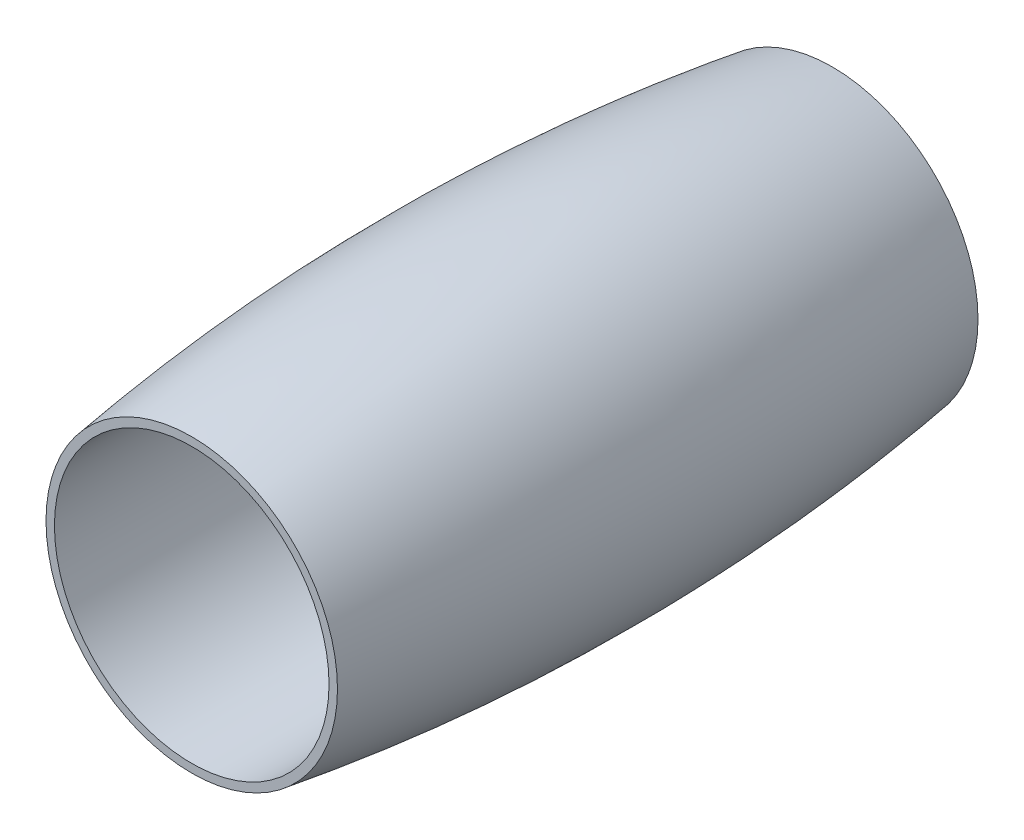
ISO-10303-21;
HEADER;
FILE_DESCRIPTION(('STEP AP214'),'2;1');
FILE_NAME('part.step','',(''),(''),'','','');
FILE_SCHEMA(('AUTOMOTIVE_DESIGN { 1 0 10303 214 1 1 1 1 }'));
ENDSEC;
DATA;
#1=APPLICATION_CONTEXT('core data for automotive mechanical design processes');
#2=APPLICATION_PROTOCOL_DEFINITION('international standard','automotive_design',2000,#1);
#3=PRODUCT_CONTEXT('',#1,'mechanical');
#4=PRODUCT('Part','Part','',(#3));
#5=PRODUCT_RELATED_PRODUCT_CATEGORY('part','',(#4));
#6=PRODUCT_DEFINITION_FORMATION('','',#4);
#7=PRODUCT_DEFINITION_CONTEXT('part definition',#1,'design');
#8=PRODUCT_DEFINITION('design','',#6,#7);
#9=PRODUCT_DEFINITION_SHAPE('','',#8);
#10=(LENGTH_UNIT() NAMED_UNIT(*) SI_UNIT(.MILLI.,.METRE.));
#11=(NAMED_UNIT(*) PLANE_ANGLE_UNIT() SI_UNIT($,.RADIAN.));
#12=(NAMED_UNIT(*) SI_UNIT($,.STERADIAN.) SOLID_ANGLE_UNIT());
#13=UNCERTAINTY_MEASURE_WITH_UNIT(LENGTH_MEASURE(1.E-05),#10,'distance_accuracy_value','');
#14=(GEOMETRIC_REPRESENTATION_CONTEXT(3) GLOBAL_UNCERTAINTY_ASSIGNED_CONTEXT((#13)) GLOBAL_UNIT_ASSIGNED_CONTEXT((#10,
#11,#12)) REPRESENTATION_CONTEXT('',''));
#15=CARTESIAN_POINT('',(0.,0.,0.));
#16=DIRECTION('',(0.,0.,1.));
#17=DIRECTION('',(1.,0.,0.));
#18=AXIS2_PLACEMENT_3D('',#15,#16,#17);
#19=CARTESIAN_POINT('',(0.,-101.5,0.));
#20=DIRECTION('',(1.,0.,0.));
#21=DIRECTION('',(0.,0.,1.));
#22=AXIS2_PLACEMENT_3D('',#19,#20,#21);
#23=ELLIPSE('',#22,169.705627484772,120.);
#24=TRIMMED_CURVE('',#23,(PARAMETER_VALUE(4.14971805766849)),
(PARAMETER_VALUE(5.27505990310089)),.T.,.PARAMETER.);
#25=CARTESIAN_POINT('',(0.,0.,1000.));
#26=DIRECTION('',(0.,0.,1.));
#27=AXIS1_PLACEMENT('',#25,#26);
#28=SURFACE_OF_REVOLUTION('',#24,#27);
#29=CARTESIAN_POINT('',(0.,0.,34.990014612751));
#30=DIRECTION('',(0.,0.,1.));
#31=DIRECTION('',(1.,0.,0.));
#32=AXIS2_PLACEMENT_3D('',#29,#30,#31);
#33=CIRCLE('',#32,15.9216736326805);
#34=CARTESIAN_POINT('',(15.9216736326805,0.,34.990014612751));
#35=VERTEX_POINT('',#34);
#36=EDGE_CURVE('E10',#35,#35,#33,.T.);
#37=ORIENTED_EDGE('',*,*,#36,.F.);
#38=EDGE_LOOP('',(#37));
#39=FACE_BOUND('',#38,.T.);
#40=CARTESIAN_POINT('',(0.,0.,-34.9900146127511));
#41=DIRECTION('',(0.,0.,1.));
#42=DIRECTION('',(1.,0.,0.));
#43=AXIS2_PLACEMENT_3D('',#40,#41,#42);
#44=CIRCLE('',#43,15.9216736326805);
#45=CARTESIAN_POINT('',(15.9216736326805,0.,-34.9900146127511));
#46=VERTEX_POINT('',#45);
#47=EDGE_CURVE('E47',#46,#46,#44,.T.);
#48=ORIENTED_EDGE('',*,*,#47,.T.);
#49=EDGE_LOOP('',(#48));
#50=FACE_BOUND('',#49,.T.);
#51=ADVANCED_FACE('F32',(#39,#50),#28,.T.);
#52=CARTESIAN_POINT('',(0.,15.9216736326805,34.9900146127509));
#53=DIRECTION('',(0.,0.,-1.));
#54=DIRECTION('',(-1.,0.,0.));
#55=AXIS2_PLACEMENT_3D('',#52,#53,#54);
#56=PLANE('',#55);
#57=CARTESIAN_POINT('',(0.,0.,34.9900146127509));
#58=DIRECTION('',(0.,0.,1.));
#59=DIRECTION('',(1.,0.,0.));
#60=AXIS2_PLACEMENT_3D('',#57,#58,#59);
#61=CIRCLE('',#60,15.);
#62=CARTESIAN_POINT('',(15.,0.,34.9900146127509));
#63=VERTEX_POINT('',#62);
#64=EDGE_CURVE('E39',#63,#63,#61,.T.);
#65=ORIENTED_EDGE('',*,*,#64,.F.);
#66=EDGE_LOOP('',(#65));
#67=FACE_BOUND('',#66,.T.);
#68=ORIENTED_EDGE('',*,*,#36,.T.);
#69=EDGE_LOOP('',(#68));
#70=FACE_BOUND('',#69,.T.);
#71=ADVANCED_FACE('F63',(#67,#70),#56,.F.);
#72=CARTESIAN_POINT('',(0.,0.,1000.));
#73=DIRECTION('',(0.,0.,1.));
#74=DIRECTION('',(1.,0.,0.));
#75=AXIS2_PLACEMENT_3D('',#72,#73,#74);
#76=CYLINDRICAL_SURFACE('',#75,15.);
#77=CARTESIAN_POINT('',(0.,0.,-34.9900146127509));
#78=DIRECTION('',(0.,0.,1.));
#79=DIRECTION('',(1.,0.,0.));
#80=AXIS2_PLACEMENT_3D('',#77,#78,#79);
#81=CIRCLE('',#80,15.);
#82=CARTESIAN_POINT('',(15.,0.,-34.9900146127509));
#83=VERTEX_POINT('',#82);
#84=EDGE_CURVE('E43',#83,#83,#81,.T.);
#85=ORIENTED_EDGE('',*,*,#84,.F.);
#86=EDGE_LOOP('',(#85));
#87=FACE_BOUND('',#86,.T.);
#88=ORIENTED_EDGE('',*,*,#64,.T.);
#89=EDGE_LOOP('',(#88));
#90=FACE_BOUND('',#89,.T.);
#91=ADVANCED_FACE('F58',(#87,#90),#76,.F.);
#92=CARTESIAN_POINT('',(0.,15.9216736326805,-34.9900146127509));
#93=DIRECTION('',(0.,0.,1.));
#94=DIRECTION('',(1.,0.,0.));
#95=AXIS2_PLACEMENT_3D('',#92,#93,#94);
#96=PLANE('',#95);
#97=ORIENTED_EDGE('',*,*,#47,.F.);
#98=EDGE_LOOP('',(#97));
#99=FACE_BOUND('',#98,.T.);
#100=ORIENTED_EDGE('',*,*,#84,.T.);
#101=EDGE_LOOP('',(#100));
#102=FACE_BOUND('',#101,.T.);
#103=ADVANCED_FACE('F55',(#99,#102),#96,.F.);
#104=CLOSED_SHELL('',(#51,#71,#91,#103));
#105=MANIFOLD_SOLID_BREP('B2',#104);
#106=ADVANCED_BREP_SHAPE_REPRESENTATION('',(#18,#105),#14);
#107=SHAPE_DEFINITION_REPRESENTATION(#9,#106);
ENDSEC;
END-ISO-10303-21;
